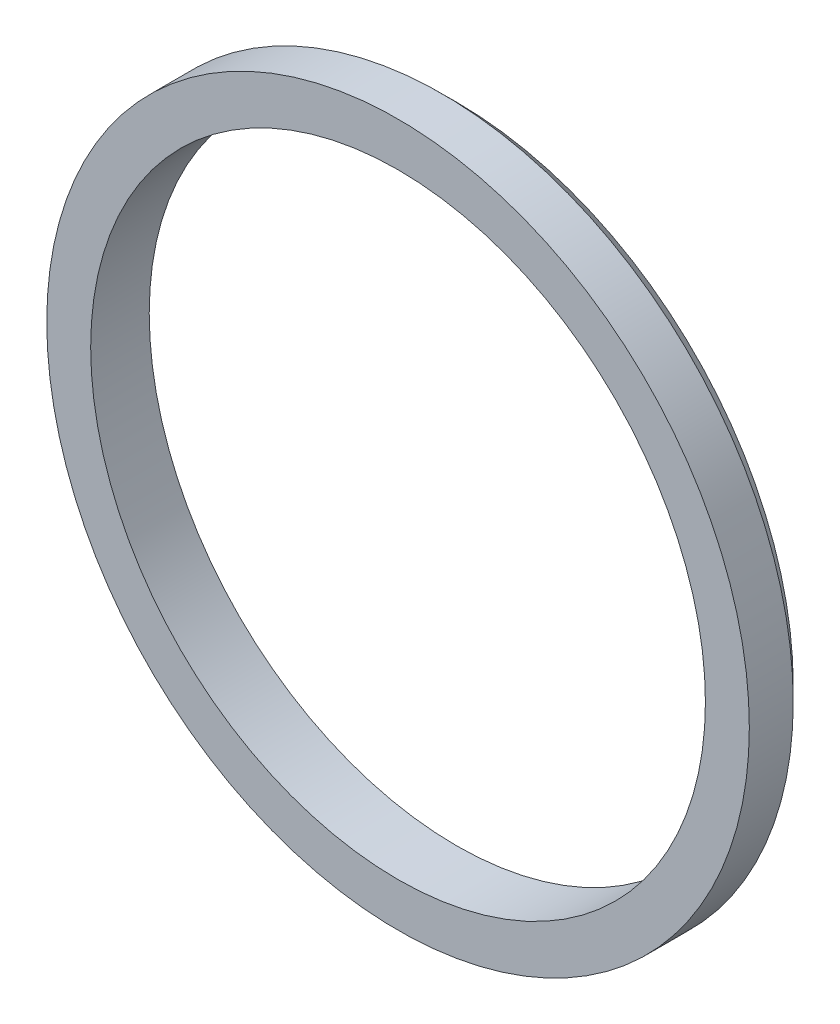
ISO-10303-21;
HEADER;
FILE_DESCRIPTION(('STEP AP214'),'2;1');
FILE_NAME('part.step','',(''),(''),'','','');
FILE_SCHEMA(('AUTOMOTIVE_DESIGN { 1 0 10303 214 1 1 1 1 }'));
ENDSEC;
DATA;
#1=APPLICATION_CONTEXT('core data for automotive mechanical design processes');
#2=APPLICATION_PROTOCOL_DEFINITION('international standard','automotive_design',2000,#1);
#3=PRODUCT_CONTEXT('',#1,'mechanical');
#4=PRODUCT('Part','Part','',(#3));
#5=PRODUCT_RELATED_PRODUCT_CATEGORY('part','',(#4));
#6=PRODUCT_DEFINITION_FORMATION('','',#4);
#7=PRODUCT_DEFINITION_CONTEXT('part definition',#1,'design');
#8=PRODUCT_DEFINITION('design','',#6,#7);
#9=PRODUCT_DEFINITION_SHAPE('','',#8);
#10=(LENGTH_UNIT() NAMED_UNIT(*) SI_UNIT(.MILLI.,.METRE.));
#11=(NAMED_UNIT(*) PLANE_ANGLE_UNIT() SI_UNIT($,.RADIAN.));
#12=(NAMED_UNIT(*) SI_UNIT($,.STERADIAN.) SOLID_ANGLE_UNIT());
#13=UNCERTAINTY_MEASURE_WITH_UNIT(LENGTH_MEASURE(1.E-05),#10,'distance_accuracy_value','');
#14=(GEOMETRIC_REPRESENTATION_CONTEXT(3) GLOBAL_UNCERTAINTY_ASSIGNED_CONTEXT((#13)) GLOBAL_UNIT_ASSIGNED_CONTEXT((#10,
#11,#12)) REPRESENTATION_CONTEXT('',''));
#15=CARTESIAN_POINT('',(0.,0.,0.));
#16=DIRECTION('',(0.,0.,1.));
#17=DIRECTION('',(1.,0.,0.));
#18=AXIS2_PLACEMENT_3D('',#15,#16,#17);
#19=CARTESIAN_POINT('',(0.,0.,1.));
#20=DIRECTION('',(0.,0.,1.));
#21=DIRECTION('',(1.,0.,0.));
#22=AXIS2_PLACEMENT_3D('',#19,#20,#21);
#23=PLANE('',#22);
#24=CARTESIAN_POINT('',(0.,0.,1.));
#25=DIRECTION('',(0.,0.,1.));
#26=DIRECTION('',(1.,0.,0.));
#27=AXIS2_PLACEMENT_3D('',#24,#25,#26);
#28=CIRCLE('',#27,12.);
#29=CARTESIAN_POINT('',(12.,0.,1.));
#30=VERTEX_POINT('',#29);
#31=EDGE_CURVE('E44',#30,#30,#28,.T.);
#32=ORIENTED_EDGE('',*,*,#31,.T.);
#33=EDGE_LOOP('',(#32));
#34=FACE_BOUND('',#33,.T.);
#35=CARTESIAN_POINT('',(0.,0.,1.));
#36=DIRECTION('',(0.,0.,1.));
#37=DIRECTION('',(1.,0.,0.));
#38=AXIS2_PLACEMENT_3D('',#35,#36,#37);
#39=CIRCLE('',#38,10.5);
#40=CARTESIAN_POINT('',(10.5,0.,1.));
#41=VERTEX_POINT('',#40);
#42=EDGE_CURVE('E48',#41,#41,#39,.T.);
#43=ORIENTED_EDGE('',*,*,#42,.F.);
#44=EDGE_LOOP('',(#43));
#45=FACE_BOUND('',#44,.T.);
#46=ADVANCED_FACE('F33',(#34,#45),#23,.T.);
#47=CARTESIAN_POINT('',(0.,0.,-1.));
#48=DIRECTION('',(0.,0.,1.));
#49=DIRECTION('',(1.,0.,0.));
#50=AXIS2_PLACEMENT_3D('',#47,#48,#49);
#51=PLANE('',#50);
#52=CARTESIAN_POINT('',(0.,0.,-1.));
#53=DIRECTION('',(0.,0.,1.));
#54=DIRECTION('',(1.,0.,0.));
#55=AXIS2_PLACEMENT_3D('',#52,#53,#54);
#56=CIRCLE('',#55,11.5);
#57=CARTESIAN_POINT('',(11.5,0.,-1.));
#58=VERTEX_POINT('',#57);
#59=EDGE_CURVE('E10',#58,#58,#56,.F.);
#60=ORIENTED_EDGE('',*,*,#59,.T.);
#61=EDGE_LOOP('',(#60));
#62=FACE_BOUND('',#61,.T.);
#63=CARTESIAN_POINT('',(0.,0.,-1.));
#64=DIRECTION('',(0.,0.,1.));
#65=DIRECTION('',(1.,0.,0.));
#66=AXIS2_PLACEMENT_3D('',#63,#64,#65);
#67=CIRCLE('',#66,10.5);
#68=CARTESIAN_POINT('',(10.5,0.,-1.));
#69=VERTEX_POINT('',#68);
#70=EDGE_CURVE('E51',#69,#69,#67,.T.);
#71=ORIENTED_EDGE('',*,*,#70,.T.);
#72=EDGE_LOOP('',(#71));
#73=FACE_BOUND('',#72,.T.);
#74=ADVANCED_FACE('F61',(#62,#73),#51,.F.);
#75=CARTESIAN_POINT('',(0.,0.,1.));
#76=DIRECTION('',(0.,0.,-1.));
#77=DIRECTION('',(-1.,0.,0.));
#78=AXIS2_PLACEMENT_3D('',#75,#76,#77);
#79=CYLINDRICAL_SURFACE('',#78,12.);
#80=CARTESIAN_POINT('',(0.,0.,-0.499999999999993));
#81=DIRECTION('',(0.,0.,1.));
#82=DIRECTION('',(1.,0.,0.));
#83=AXIS2_PLACEMENT_3D('',#80,#81,#82);
#84=CIRCLE('',#83,12.);
#85=CARTESIAN_POINT('',(12.,0.,-0.499999999999993));
#86=VERTEX_POINT('',#85);
#87=EDGE_CURVE('E40',#86,#86,#84,.T.);
#88=ORIENTED_EDGE('',*,*,#87,.T.);
#89=EDGE_LOOP('',(#88));
#90=FACE_BOUND('',#89,.T.);
#91=ORIENTED_EDGE('',*,*,#31,.F.);
#92=EDGE_LOOP('',(#91));
#93=FACE_BOUND('',#92,.T.);
#94=ADVANCED_FACE('F68',(#90,#93),#79,.T.);
#95=CARTESIAN_POINT('',(0.,0.,1.));
#96=DIRECTION('',(0.,0.,-1.));
#97=DIRECTION('',(-1.,0.,0.));
#98=AXIS2_PLACEMENT_3D('',#95,#96,#97);
#99=CYLINDRICAL_SURFACE('',#98,10.5);
#100=ORIENTED_EDGE('',*,*,#42,.T.);
#101=EDGE_LOOP('',(#100));
#102=FACE_BOUND('',#101,.T.);
#103=ORIENTED_EDGE('',*,*,#70,.F.);
#104=EDGE_LOOP('',(#103));
#105=FACE_BOUND('',#104,.T.);
#106=ADVANCED_FACE('F57',(#102,#105),#99,.F.);
#107=CARTESIAN_POINT('',(0.,0.,-0.499999999999993));
#108=DIRECTION('',(0.,0.,1.));
#109=DIRECTION('',(1.,0.,0.));
#110=AXIS2_PLACEMENT_3D('',#107,#108,#109);
#111=CONICAL_SURFACE('',#110,12.,0.785398163397448);
#112=ORIENTED_EDGE('',*,*,#59,.F.);
#113=EDGE_LOOP('',(#112));
#114=FACE_BOUND('',#113,.T.);
#115=ORIENTED_EDGE('',*,*,#87,.F.);
#116=EDGE_LOOP('',(#115));
#117=FACE_BOUND('',#116,.T.);
#118=ADVANCED_FACE('F35',(#114,#117),#111,.T.);
#119=CLOSED_SHELL('',(#46,#74,#94,#106,#118));
#120=MANIFOLD_SOLID_BREP('B2',#119);
#121=ADVANCED_BREP_SHAPE_REPRESENTATION('',(#18,#120),#14);
#122=SHAPE_DEFINITION_REPRESENTATION(#9,#121);
ENDSEC;
END-ISO-10303-21;
